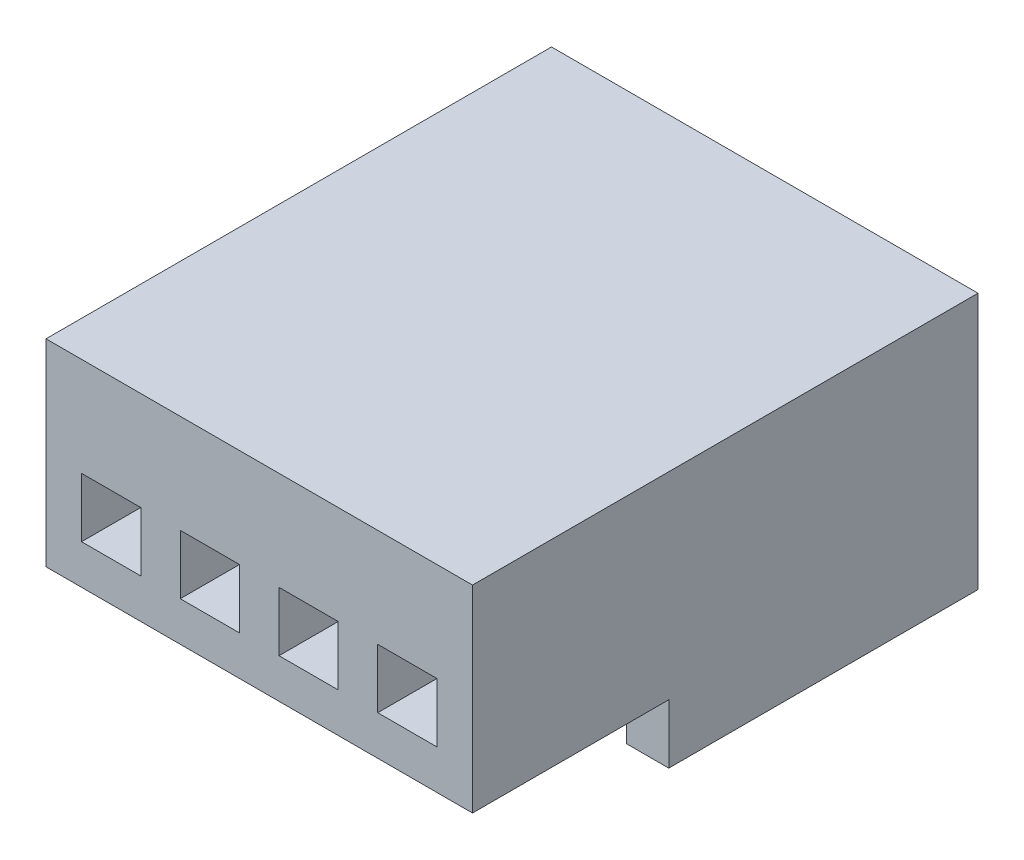
ISO-10303-21;
HEADER;
FILE_DESCRIPTION(('STEP AP214'),'2;1');
FILE_NAME('part.step','',(''),(''),'','','');
FILE_SCHEMA(('AUTOMOTIVE_DESIGN { 1 0 10303 214 1 1 1 1 }'));
ENDSEC;
DATA;
#1=APPLICATION_CONTEXT('core data for automotive mechanical design processes');
#2=APPLICATION_PROTOCOL_DEFINITION('international standard','automotive_design',2000,#1);
#3=PRODUCT_CONTEXT('',#1,'mechanical');
#4=PRODUCT('Part','Part','',(#3));
#5=PRODUCT_RELATED_PRODUCT_CATEGORY('part','',(#4));
#6=PRODUCT_DEFINITION_FORMATION('','',#4);
#7=PRODUCT_DEFINITION_CONTEXT('part definition',#1,'design');
#8=PRODUCT_DEFINITION('design','',#6,#7);
#9=PRODUCT_DEFINITION_SHAPE('','',#8);
#10=(LENGTH_UNIT() NAMED_UNIT(*) SI_UNIT(.MILLI.,.METRE.));
#11=(NAMED_UNIT(*) PLANE_ANGLE_UNIT() SI_UNIT($,.RADIAN.));
#12=(NAMED_UNIT(*) SI_UNIT($,.STERADIAN.) SOLID_ANGLE_UNIT());
#13=UNCERTAINTY_MEASURE_WITH_UNIT(LENGTH_MEASURE(1.E-05),#10,'distance_accuracy_value','');
#14=(GEOMETRIC_REPRESENTATION_CONTEXT(3) GLOBAL_UNCERTAINTY_ASSIGNED_CONTEXT((#13)) GLOBAL_UNIT_ASSIGNED_CONTEXT((#10,
#11,#12)) REPRESENTATION_CONTEXT('',''));
#15=CARTESIAN_POINT('',(0.,0.,0.));
#16=DIRECTION('',(0.,0.,1.));
#17=DIRECTION('',(1.,0.,0.));
#18=AXIS2_PLACEMENT_3D('',#15,#16,#17);
#19=CARTESIAN_POINT('',(0.,0.,0.));
#20=DIRECTION('',(0.,-1.,0.));
#21=DIRECTION('',(0.,0.,-1.));
#22=AXIS2_PLACEMENT_3D('',#19,#20,#21);
#23=PLANE('',#22);
#24=DIRECTION('',(0.,0.,-1.));
#25=VECTOR('',#24,1.);
#26=CARTESIAN_POINT('',(4.33491797227326,0.,-12.8));
#27=LINE('',#26,#25);
#28=CARTESIAN_POINT('',(4.33491797227326,0.,-4.96930572851849));
#29=VERTEX_POINT('',#28);
#30=CARTESIAN_POINT('',(4.33491797227325,0.,-12.8));
#31=VERTEX_POINT('',#30);
#32=EDGE_CURVE('E225',#29,#31,#27,.T.);
#33=ORIENTED_EDGE('',*,*,#32,.F.);
#34=DIRECTION('',(-1.,0.,0.));
#35=VECTOR('',#34,1.);
#36=CARTESIAN_POINT('',(5.4,0.,-4.96930572851849));
#37=LINE('',#36,#35);
#38=CARTESIAN_POINT('',(5.4,0.,-4.96930572851849));
#39=VERTEX_POINT('',#38);
#40=EDGE_CURVE('E412',#39,#29,#37,.T.);
#41=ORIENTED_EDGE('',*,*,#40,.F.);
#42=DIRECTION('',(0.,0.,-1.));
#43=VECTOR('',#42,1.);
#44=CARTESIAN_POINT('',(5.4,0.,0.));
#45=LINE('',#44,#43);
#46=CARTESIAN_POINT('',(5.4,0.,0.));
#47=VERTEX_POINT('',#46);
#48=EDGE_CURVE('E231',#47,#39,#45,.T.);
#49=ORIENTED_EDGE('',*,*,#48,.F.);
#50=DIRECTION('',(1.,0.,0.));
#51=VECTOR('',#50,1.);
#52=CARTESIAN_POINT('',(-5.4,0.,0.));
#53=LINE('',#52,#51);
#54=CARTESIAN_POINT('',(-5.4,0.,0.));
#55=VERTEX_POINT('',#54);
#56=EDGE_CURVE('E400',#55,#47,#53,.T.);
#57=ORIENTED_EDGE('',*,*,#56,.F.);
#58=DIRECTION('',(0.,0.,1.));
#59=VECTOR('',#58,1.);
#60=CARTESIAN_POINT('',(-5.4,0.,0.));
#61=LINE('',#60,#59);
#62=CARTESIAN_POINT('',(-5.4,0.,-4.96930572851849));
#63=VERTEX_POINT('',#62);
#64=EDGE_CURVE('E288',#63,#55,#61,.T.);
#65=ORIENTED_EDGE('',*,*,#64,.F.);
#66=DIRECTION('',(-1.,0.,0.));
#67=VECTOR('',#66,1.);
#68=CARTESIAN_POINT('',(-5.4,0.,-4.96930572851849));
#69=LINE('',#68,#67);
#70=CARTESIAN_POINT('',(-4.42058828793083,0.,-4.96930572851849));
#71=VERTEX_POINT('',#70);
#72=EDGE_CURVE('E235',#71,#63,#69,.T.);
#73=ORIENTED_EDGE('',*,*,#72,.F.);
#74=DIRECTION('',(0.,0.,1.));
#75=VECTOR('',#74,1.);
#76=CARTESIAN_POINT('',(-4.42058828793083,0.,-12.8));
#77=LINE('',#76,#75);
#78=CARTESIAN_POINT('',(-4.42058828793083,0.,-12.8));
#79=VERTEX_POINT('',#78);
#80=EDGE_CURVE('E232',#79,#71,#77,.T.);
#81=ORIENTED_EDGE('',*,*,#80,.F.);
#82=DIRECTION('',(-1.,0.,0.));
#83=VECTOR('',#82,1.);
#84=CARTESIAN_POINT('',(-5.4,0.,-12.8));
#85=LINE('',#84,#83);
#86=EDGE_CURVE('E53',#31,#79,#85,.T.);
#87=ORIENTED_EDGE('',*,*,#86,.F.);
#88=EDGE_LOOP('',(#33,#41,#49,#57,#65,#73,#81,#87));
#89=FACE_BOUND('',#88,.T.);
#90=ADVANCED_FACE('F33',(#89),#23,.T.);
#91=CARTESIAN_POINT('',(-5.4,5.,0.));
#92=DIRECTION('',(1.,0.,0.));
#93=DIRECTION('',(0.,0.,-1.));
#94=AXIS2_PLACEMENT_3D('',#91,#92,#93);
#95=PLANE('',#94);
#96=DIRECTION('',(0.,-1.,0.));
#97=VECTOR('',#96,1.);
#98=CARTESIAN_POINT('',(-5.4,5.,-12.8));
#99=LINE('',#98,#97);
#100=CARTESIAN_POINT('',(-5.4,5.,-12.8));
#101=VERTEX_POINT('',#100);
#102=CARTESIAN_POINT('',(-5.4,-1.5,-12.8));
#103=VERTEX_POINT('',#102);
#104=EDGE_CURVE('E398',#101,#103,#99,.T.);
#105=ORIENTED_EDGE('',*,*,#104,.T.);
#106=DIRECTION('',(0.,0.,-1.));
#107=VECTOR('',#106,1.);
#108=CARTESIAN_POINT('',(-5.4,-1.5,-12.8));
#109=LINE('',#108,#107);
#110=CARTESIAN_POINT('',(-5.4,-1.5,-4.96930572851849));
#111=VERTEX_POINT('',#110);
#112=EDGE_CURVE('E240',#111,#103,#109,.T.);
#113=ORIENTED_EDGE('',*,*,#112,.F.);
#114=DIRECTION('',(0.,1.,0.));
#115=VECTOR('',#114,1.);
#116=CARTESIAN_POINT('',(-5.4,-1.5,-4.96930572851849));
#117=LINE('',#116,#115);
#118=EDGE_CURVE('E248',#111,#63,#117,.T.);
#119=ORIENTED_EDGE('',*,*,#118,.T.);
#120=ORIENTED_EDGE('',*,*,#64,.T.);
#121=DIRECTION('',(0.,-1.,0.));
#122=VECTOR('',#121,1.);
#123=CARTESIAN_POINT('',(-5.4,5.,0.));
#124=LINE('',#123,#122);
#125=CARTESIAN_POINT('',(-5.4,5.,0.));
#126=VERTEX_POINT('',#125);
#127=EDGE_CURVE('E11',#126,#55,#124,.T.);
#128=ORIENTED_EDGE('',*,*,#127,.F.);
#129=DIRECTION('',(0.,0.,1.));
#130=VECTOR('',#129,1.);
#131=CARTESIAN_POINT('',(-5.4,5.,0.));
#132=LINE('',#131,#130);
#133=EDGE_CURVE('E389',#101,#126,#132,.T.);
#134=ORIENTED_EDGE('',*,*,#133,.F.);
#135=EDGE_LOOP('',(#105,#113,#119,#120,#128,#134));
#136=FACE_BOUND('',#135,.T.);
#137=ADVANCED_FACE('F35',(#136),#95,.F.);
#138=CARTESIAN_POINT('',(-5.4,5.,0.));
#139=DIRECTION('',(0.,0.,-1.));
#140=DIRECTION('',(-1.,0.,0.));
#141=AXIS2_PLACEMENT_3D('',#138,#139,#140);
#142=PLANE('',#141);
#143=DIRECTION('',(1.,0.,0.));
#144=VECTOR('',#143,1.);
#145=CARTESIAN_POINT('',(4.5,2.5,0.));
#146=LINE('',#145,#144);
#147=CARTESIAN_POINT('',(3.,2.5,0.));
#148=VERTEX_POINT('',#147);
#149=CARTESIAN_POINT('',(4.5,2.5,0.));
#150=VERTEX_POINT('',#149);
#151=EDGE_CURVE('E271',#148,#150,#146,.T.);
#152=ORIENTED_EDGE('',*,*,#151,.T.);
#153=DIRECTION('',(0.,-1.,0.));
#154=VECTOR('',#153,1.);
#155=CARTESIAN_POINT('',(4.5,2.5,0.));
#156=LINE('',#155,#154);
#157=CARTESIAN_POINT('',(4.5,1.,0.));
#158=VERTEX_POINT('',#157);
#159=EDGE_CURVE('E261',#150,#158,#156,.T.);
#160=ORIENTED_EDGE('',*,*,#159,.T.);
#161=DIRECTION('',(-1.,0.,0.));
#162=VECTOR('',#161,1.);
#163=CARTESIAN_POINT('',(4.5,1.,0.));
#164=LINE('',#163,#162);
#165=CARTESIAN_POINT('',(3.,1.,0.));
#166=VERTEX_POINT('',#165);
#167=EDGE_CURVE('E264',#158,#166,#164,.T.);
#168=ORIENTED_EDGE('',*,*,#167,.T.);
#169=DIRECTION('',(0.,1.,0.));
#170=VECTOR('',#169,1.);
#171=CARTESIAN_POINT('',(3.,2.5,0.));
#172=LINE('',#171,#170);
#173=EDGE_CURVE('E268',#166,#148,#172,.T.);
#174=ORIENTED_EDGE('',*,*,#173,.T.);
#175=EDGE_LOOP('',(#152,#160,#168,#174));
#176=FACE_BOUND('',#175,.T.);
#177=DIRECTION('',(1.,0.,0.));
#178=VECTOR('',#177,1.);
#179=CARTESIAN_POINT('',(2.,2.5,0.));
#180=LINE('',#179,#178);
#181=CARTESIAN_POINT('',(0.5,2.5,0.));
#182=VERTEX_POINT('',#181);
#183=CARTESIAN_POINT('',(2.,2.5,0.));
#184=VERTEX_POINT('',#183);
#185=EDGE_CURVE('E305',#182,#184,#180,.T.);
#186=ORIENTED_EDGE('',*,*,#185,.T.);
#187=DIRECTION('',(0.,-1.,0.));
#188=VECTOR('',#187,1.);
#189=CARTESIAN_POINT('',(2.,2.5,0.));
#190=LINE('',#189,#188);
#191=CARTESIAN_POINT('',(2.,1.,0.));
#192=VERTEX_POINT('',#191);
#193=EDGE_CURVE('E295',#184,#192,#190,.T.);
#194=ORIENTED_EDGE('',*,*,#193,.T.);
#195=DIRECTION('',(-1.,0.,0.));
#196=VECTOR('',#195,1.);
#197=CARTESIAN_POINT('',(2.,1.,0.));
#198=LINE('',#197,#196);
#199=CARTESIAN_POINT('',(0.499999999999999,1.,0.));
#200=VERTEX_POINT('',#199);
#201=EDGE_CURVE('E298',#192,#200,#198,.T.);
#202=ORIENTED_EDGE('',*,*,#201,.T.);
#203=DIRECTION('',(0.,1.,0.));
#204=VECTOR('',#203,1.);
#205=CARTESIAN_POINT('',(0.5,2.5,0.));
#206=LINE('',#205,#204);
#207=EDGE_CURVE('E302',#200,#182,#206,.T.);
#208=ORIENTED_EDGE('',*,*,#207,.T.);
#209=EDGE_LOOP('',(#186,#194,#202,#208));
#210=FACE_BOUND('',#209,.T.);
#211=DIRECTION('',(1.,0.,0.));
#212=VECTOR('',#211,1.);
#213=CARTESIAN_POINT('',(-0.5,2.5,0.));
#214=LINE('',#213,#212);
#215=CARTESIAN_POINT('',(-2.,2.5,0.));
#216=VERTEX_POINT('',#215);
#217=CARTESIAN_POINT('',(-0.5,2.5,0.));
#218=VERTEX_POINT('',#217);
#219=EDGE_CURVE('E337',#216,#218,#214,.T.);
#220=ORIENTED_EDGE('',*,*,#219,.T.);
#221=DIRECTION('',(0.,-1.,0.));
#222=VECTOR('',#221,1.);
#223=CARTESIAN_POINT('',(-0.5,2.5,0.));
#224=LINE('',#223,#222);
#225=CARTESIAN_POINT('',(-0.500000000000001,1.,0.));
#226=VERTEX_POINT('',#225);
#227=EDGE_CURVE('E327',#218,#226,#224,.T.);
#228=ORIENTED_EDGE('',*,*,#227,.T.);
#229=DIRECTION('',(-1.,0.,0.));
#230=VECTOR('',#229,1.);
#231=CARTESIAN_POINT('',(-0.500000000000001,1.,0.));
#232=LINE('',#231,#230);
#233=CARTESIAN_POINT('',(-2.,1.,0.));
#234=VERTEX_POINT('',#233);
#235=EDGE_CURVE('E330',#226,#234,#232,.T.);
#236=ORIENTED_EDGE('',*,*,#235,.T.);
#237=DIRECTION('',(0.,1.,0.));
#238=VECTOR('',#237,1.);
#239=CARTESIAN_POINT('',(-2.,2.5,0.));
#240=LINE('',#239,#238);
#241=EDGE_CURVE('E334',#234,#216,#240,.T.);
#242=ORIENTED_EDGE('',*,*,#241,.T.);
#243=EDGE_LOOP('',(#220,#228,#236,#242));
#244=FACE_BOUND('',#243,.T.);
#245=DIRECTION('',(1.,0.,0.));
#246=VECTOR('',#245,1.);
#247=CARTESIAN_POINT('',(-3.,2.5,0.));
#248=LINE('',#247,#246);
#249=CARTESIAN_POINT('',(-4.5,2.5,0.));
#250=VERTEX_POINT('',#249);
#251=CARTESIAN_POINT('',(-3.,2.5,0.));
#252=VERTEX_POINT('',#251);
#253=EDGE_CURVE('E369',#250,#252,#248,.T.);
#254=ORIENTED_EDGE('',*,*,#253,.T.);
#255=DIRECTION('',(0.,-1.,0.));
#256=VECTOR('',#255,1.);
#257=CARTESIAN_POINT('',(-3.,2.5,0.));
#258=LINE('',#257,#256);
#259=CARTESIAN_POINT('',(-3.,1.,0.));
#260=VERTEX_POINT('',#259);
#261=EDGE_CURVE('E359',#252,#260,#258,.T.);
#262=ORIENTED_EDGE('',*,*,#261,.T.);
#263=DIRECTION('',(-1.,0.,0.));
#264=VECTOR('',#263,1.);
#265=CARTESIAN_POINT('',(-3.,1.,0.));
#266=LINE('',#265,#264);
#267=CARTESIAN_POINT('',(-4.5,1.,0.));
#268=VERTEX_POINT('',#267);
#269=EDGE_CURVE('E362',#260,#268,#266,.T.);
#270=ORIENTED_EDGE('',*,*,#269,.T.);
#271=DIRECTION('',(0.,1.,0.));
#272=VECTOR('',#271,1.);
#273=CARTESIAN_POINT('',(-4.5,2.5,0.));
#274=LINE('',#273,#272);
#275=EDGE_CURVE('E366',#268,#250,#274,.T.);
#276=ORIENTED_EDGE('',*,*,#275,.T.);
#277=EDGE_LOOP('',(#254,#262,#270,#276));
#278=FACE_BOUND('',#277,.T.);
#279=ORIENTED_EDGE('',*,*,#56,.T.);
#280=DIRECTION('',(0.,-1.,0.));
#281=VECTOR('',#280,1.);
#282=CARTESIAN_POINT('',(5.4,5.,0.));
#283=LINE('',#282,#281);
#284=CARTESIAN_POINT('',(5.4,5.,0.));
#285=VERTEX_POINT('',#284);
#286=EDGE_CURVE('E41',#285,#47,#283,.T.);
#287=ORIENTED_EDGE('',*,*,#286,.F.);
#288=DIRECTION('',(1.,0.,0.));
#289=VECTOR('',#288,1.);
#290=CARTESIAN_POINT('',(-5.4,5.,0.));
#291=LINE('',#290,#289);
#292=EDGE_CURVE('E392',#126,#285,#291,.T.);
#293=ORIENTED_EDGE('',*,*,#292,.F.);
#294=ORIENTED_EDGE('',*,*,#127,.T.);
#295=EDGE_LOOP('',(#279,#287,#293,#294));
#296=FACE_BOUND('',#295,.T.);
#297=ADVANCED_FACE('F427',(#176,#210,#244,#278,#296),#142,.F.);
#298=CARTESIAN_POINT('',(5.4,5.,0.));
#299=DIRECTION('',(-1.,0.,0.));
#300=DIRECTION('',(0.,0.,1.));
#301=AXIS2_PLACEMENT_3D('',#298,#299,#300);
#302=PLANE('',#301);
#303=ORIENTED_EDGE('',*,*,#48,.T.);
#304=DIRECTION('',(0.,1.,0.));
#305=VECTOR('',#304,1.);
#306=CARTESIAN_POINT('',(5.4,-1.5,-4.96930572851849));
#307=LINE('',#306,#305);
#308=CARTESIAN_POINT('',(5.4,-1.5,-4.96930572851849));
#309=VERTEX_POINT('',#308);
#310=EDGE_CURVE('E210',#309,#39,#307,.T.);
#311=ORIENTED_EDGE('',*,*,#310,.F.);
#312=DIRECTION('',(0.,0.,1.));
#313=VECTOR('',#312,1.);
#314=CARTESIAN_POINT('',(5.4,-1.5,-12.8));
#315=LINE('',#314,#313);
#316=CARTESIAN_POINT('',(5.4,-1.5,-12.8));
#317=VERTEX_POINT('',#316);
#318=EDGE_CURVE('E217',#317,#309,#315,.T.);
#319=ORIENTED_EDGE('',*,*,#318,.F.);
#320=DIRECTION('',(0.,-1.,0.));
#321=VECTOR('',#320,1.);
#322=CARTESIAN_POINT('',(5.4,5.,-12.8));
#323=LINE('',#322,#321);
#324=CARTESIAN_POINT('',(5.4,5.,-12.8));
#325=VERTEX_POINT('',#324);
#326=EDGE_CURVE('E405',#325,#317,#323,.T.);
#327=ORIENTED_EDGE('',*,*,#326,.F.);
#328=DIRECTION('',(0.,0.,-1.));
#329=VECTOR('',#328,1.);
#330=CARTESIAN_POINT('',(5.4,5.,0.));
#331=LINE('',#330,#329);
#332=EDGE_CURVE('E394',#285,#325,#331,.T.);
#333=ORIENTED_EDGE('',*,*,#332,.F.);
#334=ORIENTED_EDGE('',*,*,#286,.T.);
#335=EDGE_LOOP('',(#303,#311,#319,#327,#333,#334));
#336=FACE_BOUND('',#335,.T.);
#337=ADVANCED_FACE('F228',(#336),#302,.F.);
#338=CARTESIAN_POINT('',(-5.4,5.,-12.8));
#339=DIRECTION('',(0.,0.,1.));
#340=DIRECTION('',(1.,0.,0.));
#341=AXIS2_PLACEMENT_3D('',#338,#339,#340);
#342=PLANE('',#341);
#343=DIRECTION('',(-1.,0.,0.));
#344=VECTOR('',#343,1.);
#345=CARTESIAN_POINT('',(4.5,1.,-12.8));
#346=LINE('',#345,#344);
#347=CARTESIAN_POINT('',(4.5,1.,-12.8));
#348=VERTEX_POINT('',#347);
#349=CARTESIAN_POINT('',(3.,1.,-12.8));
#350=VERTEX_POINT('',#349);
#351=EDGE_CURVE('E277',#348,#350,#346,.T.);
#352=ORIENTED_EDGE('',*,*,#351,.F.);
#353=DIRECTION('',(0.,-1.,0.));
#354=VECTOR('',#353,1.);
#355=CARTESIAN_POINT('',(4.5,2.5,-12.8));
#356=LINE('',#355,#354);
#357=CARTESIAN_POINT('',(4.5,2.5,-12.8));
#358=VERTEX_POINT('',#357);
#359=EDGE_CURVE('E275',#358,#348,#356,.T.);
#360=ORIENTED_EDGE('',*,*,#359,.F.);
#361=DIRECTION('',(1.,0.,0.));
#362=VECTOR('',#361,1.);
#363=CARTESIAN_POINT('',(4.5,2.5,-12.8));
#364=LINE('',#363,#362);
#365=CARTESIAN_POINT('',(3.,2.5,-12.8));
#366=VERTEX_POINT('',#365);
#367=EDGE_CURVE('E265',#366,#358,#364,.T.);
#368=ORIENTED_EDGE('',*,*,#367,.F.);
#369=DIRECTION('',(0.,1.,0.));
#370=VECTOR('',#369,1.);
#371=CARTESIAN_POINT('',(3.,2.5,-12.8));
#372=LINE('',#371,#370);
#373=EDGE_CURVE('E281',#350,#366,#372,.T.);
#374=ORIENTED_EDGE('',*,*,#373,.F.);
#375=EDGE_LOOP('',(#352,#360,#368,#374));
#376=FACE_BOUND('',#375,.T.);
#377=DIRECTION('',(-1.,0.,0.));
#378=VECTOR('',#377,1.);
#379=CARTESIAN_POINT('',(2.,1.,-12.8));
#380=LINE('',#379,#378);
#381=CARTESIAN_POINT('',(2.,1.,-12.8));
#382=VERTEX_POINT('',#381);
#383=CARTESIAN_POINT('',(0.499999999999999,1.,-12.8));
#384=VERTEX_POINT('',#383);
#385=EDGE_CURVE('E311',#382,#384,#380,.T.);
#386=ORIENTED_EDGE('',*,*,#385,.F.);
#387=DIRECTION('',(0.,-1.,0.));
#388=VECTOR('',#387,1.);
#389=CARTESIAN_POINT('',(2.,2.5,-12.8));
#390=LINE('',#389,#388);
#391=CARTESIAN_POINT('',(2.,2.5,-12.8));
#392=VERTEX_POINT('',#391);
#393=EDGE_CURVE('E309',#392,#382,#390,.T.);
#394=ORIENTED_EDGE('',*,*,#393,.F.);
#395=DIRECTION('',(1.,0.,0.));
#396=VECTOR('',#395,1.);
#397=CARTESIAN_POINT('',(2.,2.5,-12.8));
#398=LINE('',#397,#396);
#399=CARTESIAN_POINT('',(0.5,2.5,-12.8));
#400=VERTEX_POINT('',#399);
#401=EDGE_CURVE('E299',#400,#392,#398,.T.);
#402=ORIENTED_EDGE('',*,*,#401,.F.);
#403=DIRECTION('',(0.,1.,0.));
#404=VECTOR('',#403,1.);
#405=CARTESIAN_POINT('',(0.5,2.5,-12.8));
#406=LINE('',#405,#404);
#407=EDGE_CURVE('E315',#384,#400,#406,.T.);
#408=ORIENTED_EDGE('',*,*,#407,.F.);
#409=EDGE_LOOP('',(#386,#394,#402,#408));
#410=FACE_BOUND('',#409,.T.);
#411=DIRECTION('',(-1.,0.,0.));
#412=VECTOR('',#411,1.);
#413=CARTESIAN_POINT('',(-0.500000000000001,1.,-12.8));
#414=LINE('',#413,#412);
#415=CARTESIAN_POINT('',(-0.5,1.,-12.8));
#416=VERTEX_POINT('',#415);
#417=CARTESIAN_POINT('',(-2.,1.,-12.8));
#418=VERTEX_POINT('',#417);
#419=EDGE_CURVE('E343',#416,#418,#414,.T.);
#420=ORIENTED_EDGE('',*,*,#419,.F.);
#421=DIRECTION('',(0.,-1.,0.));
#422=VECTOR('',#421,1.);
#423=CARTESIAN_POINT('',(-0.5,2.5,-12.8));
#424=LINE('',#423,#422);
#425=CARTESIAN_POINT('',(-0.5,2.5,-12.8));
#426=VERTEX_POINT('',#425);
#427=EDGE_CURVE('E341',#426,#416,#424,.T.);
#428=ORIENTED_EDGE('',*,*,#427,.F.);
#429=DIRECTION('',(1.,0.,0.));
#430=VECTOR('',#429,1.);
#431=CARTESIAN_POINT('',(-0.5,2.5,-12.8));
#432=LINE('',#431,#430);
#433=CARTESIAN_POINT('',(-2.,2.5,-12.8));
#434=VERTEX_POINT('',#433);
#435=EDGE_CURVE('E331',#434,#426,#432,.T.);
#436=ORIENTED_EDGE('',*,*,#435,.F.);
#437=DIRECTION('',(0.,1.,0.));
#438=VECTOR('',#437,1.);
#439=CARTESIAN_POINT('',(-2.,2.5,-12.8));
#440=LINE('',#439,#438);
#441=EDGE_CURVE('E347',#418,#434,#440,.T.);
#442=ORIENTED_EDGE('',*,*,#441,.F.);
#443=EDGE_LOOP('',(#420,#428,#436,#442));
#444=FACE_BOUND('',#443,.T.);
#445=DIRECTION('',(-1.,0.,0.));
#446=VECTOR('',#445,1.);
#447=CARTESIAN_POINT('',(-3.,1.,-12.8));
#448=LINE('',#447,#446);
#449=CARTESIAN_POINT('',(-3.,1.,-12.8));
#450=VERTEX_POINT('',#449);
#451=CARTESIAN_POINT('',(-4.5,1.,-12.8));
#452=VERTEX_POINT('',#451);
#453=EDGE_CURVE('E374',#450,#452,#448,.T.);
#454=ORIENTED_EDGE('',*,*,#453,.F.);
#455=DIRECTION('',(0.,-1.,0.));
#456=VECTOR('',#455,1.);
#457=CARTESIAN_POINT('',(-3.,2.5,-12.8));
#458=LINE('',#457,#456);
#459=CARTESIAN_POINT('',(-3.,2.5,-12.8));
#460=VERTEX_POINT('',#459);
#461=EDGE_CURVE('E260',#460,#450,#458,.T.);
#462=ORIENTED_EDGE('',*,*,#461,.F.);
#463=DIRECTION('',(1.,0.,0.));
#464=VECTOR('',#463,1.);
#465=CARTESIAN_POINT('',(-3.,2.5,-12.8));
#466=LINE('',#465,#464);
#467=CARTESIAN_POINT('',(-4.5,2.5,-12.8));
#468=VERTEX_POINT('',#467);
#469=EDGE_CURVE('E363',#468,#460,#466,.T.);
#470=ORIENTED_EDGE('',*,*,#469,.F.);
#471=DIRECTION('',(0.,1.,0.));
#472=VECTOR('',#471,1.);
#473=CARTESIAN_POINT('',(-4.5,2.5,-12.8));
#474=LINE('',#473,#472);
#475=EDGE_CURVE('E377',#452,#468,#474,.T.);
#476=ORIENTED_EDGE('',*,*,#475,.F.);
#477=EDGE_LOOP('',(#454,#462,#470,#476));
#478=FACE_BOUND('',#477,.T.);
#479=ORIENTED_EDGE('',*,*,#326,.T.);
#480=DIRECTION('',(1.,0.,0.));
#481=VECTOR('',#480,1.);
#482=CARTESIAN_POINT('',(5.4,-1.5,-12.8));
#483=LINE('',#482,#481);
#484=CARTESIAN_POINT('',(4.33491797227326,-1.5,-12.8));
#485=VERTEX_POINT('',#484);
#486=EDGE_CURVE('E222',#485,#317,#483,.T.);
#487=ORIENTED_EDGE('',*,*,#486,.F.);
#488=DIRECTION('',(0.,1.,0.));
#489=VECTOR('',#488,1.);
#490=CARTESIAN_POINT('',(4.33491797227326,-1.5,-12.8));
#491=LINE('',#490,#489);
#492=EDGE_CURVE('E48',#485,#31,#491,.T.);
#493=ORIENTED_EDGE('',*,*,#492,.T.);
#494=ORIENTED_EDGE('',*,*,#86,.T.);
#495=DIRECTION('',(0.,1.,0.));
#496=VECTOR('',#495,1.);
#497=CARTESIAN_POINT('',(-4.42058828793083,-1.5,-12.8));
#498=LINE('',#497,#496);
#499=CARTESIAN_POINT('',(-4.42058828793083,-1.5,-12.8));
#500=VERTEX_POINT('',#499);
#501=EDGE_CURVE('E257',#500,#79,#498,.T.);
#502=ORIENTED_EDGE('',*,*,#501,.F.);
#503=DIRECTION('',(1.,0.,0.));
#504=VECTOR('',#503,1.);
#505=CARTESIAN_POINT('',(-5.4,-1.5,-12.8));
#506=LINE('',#505,#504);
#507=EDGE_CURVE('E243',#103,#500,#506,.T.);
#508=ORIENTED_EDGE('',*,*,#507,.F.);
#509=ORIENTED_EDGE('',*,*,#104,.F.);
#510=DIRECTION('',(-1.,0.,0.));
#511=VECTOR('',#510,1.);
#512=CARTESIAN_POINT('',(-5.4,5.,-12.8));
#513=LINE('',#512,#511);
#514=EDGE_CURVE('E396',#325,#101,#513,.T.);
#515=ORIENTED_EDGE('',*,*,#514,.F.);
#516=EDGE_LOOP('',(#479,#487,#493,#494,#502,#508,#509,#515));
#517=FACE_BOUND('',#516,.T.);
#518=ADVANCED_FACE('F419',(#376,#410,#444,#478,#517),#342,.F.);
#519=CARTESIAN_POINT('',(0.,5.,0.));
#520=DIRECTION('',(0.,-1.,0.));
#521=DIRECTION('',(0.,0.,-1.));
#522=AXIS2_PLACEMENT_3D('',#519,#520,#521);
#523=PLANE('',#522);
#524=ORIENTED_EDGE('',*,*,#133,.T.);
#525=ORIENTED_EDGE('',*,*,#292,.T.);
#526=ORIENTED_EDGE('',*,*,#332,.T.);
#527=ORIENTED_EDGE('',*,*,#514,.T.);
#528=EDGE_LOOP('',(#524,#525,#526,#527));
#529=FACE_BOUND('',#528,.T.);
#530=ADVANCED_FACE('F425',(#529),#523,.F.);
#531=CARTESIAN_POINT('',(-3.,2.5,0.));
#532=DIRECTION('',(1.,0.,0.));
#533=DIRECTION('',(0.,0.,-1.));
#534=AXIS2_PLACEMENT_3D('',#531,#532,#533);
#535=PLANE('',#534);
#536=ORIENTED_EDGE('',*,*,#461,.T.);
#537=DIRECTION('',(0.,0.,-1.));
#538=VECTOR('',#537,1.);
#539=CARTESIAN_POINT('',(-3.,1.,0.));
#540=LINE('',#539,#538);
#541=EDGE_CURVE('E372',#260,#450,#540,.T.);
#542=ORIENTED_EDGE('',*,*,#541,.F.);
#543=ORIENTED_EDGE('',*,*,#261,.F.);
#544=DIRECTION('',(0.,0.,-1.));
#545=VECTOR('',#544,1.);
#546=CARTESIAN_POINT('',(-3.,2.5,0.));
#547=LINE('',#546,#545);
#548=EDGE_CURVE('E344',#252,#460,#547,.T.);
#549=ORIENTED_EDGE('',*,*,#548,.T.);
#550=EDGE_LOOP('',(#536,#542,#543,#549));
#551=FACE_BOUND('',#550,.T.);
#552=ADVANCED_FACE('F477',(#551),#535,.F.);
#553=CARTESIAN_POINT('',(-3.,2.5,0.));
#554=DIRECTION('',(0.,1.,0.));
#555=DIRECTION('',(0.,0.,1.));
#556=AXIS2_PLACEMENT_3D('',#553,#554,#555);
#557=PLANE('',#556);
#558=ORIENTED_EDGE('',*,*,#469,.T.);
#559=ORIENTED_EDGE('',*,*,#548,.F.);
#560=ORIENTED_EDGE('',*,*,#253,.F.);
#561=DIRECTION('',(0.,0.,-1.));
#562=VECTOR('',#561,1.);
#563=CARTESIAN_POINT('',(-4.5,2.5,0.));
#564=LINE('',#563,#562);
#565=EDGE_CURVE('E383',#250,#468,#564,.T.);
#566=ORIENTED_EDGE('',*,*,#565,.T.);
#567=EDGE_LOOP('',(#558,#559,#560,#566));
#568=FACE_BOUND('',#567,.T.);
#569=ADVANCED_FACE('F473',(#568),#557,.F.);
#570=CARTESIAN_POINT('',(-4.5,2.5,0.));
#571=DIRECTION('',(-1.,0.,0.));
#572=DIRECTION('',(0.,0.,1.));
#573=AXIS2_PLACEMENT_3D('',#570,#571,#572);
#574=PLANE('',#573);
#575=ORIENTED_EDGE('',*,*,#475,.T.);
#576=ORIENTED_EDGE('',*,*,#565,.F.);
#577=ORIENTED_EDGE('',*,*,#275,.F.);
#578=DIRECTION('',(0.,0.,-1.));
#579=VECTOR('',#578,1.);
#580=CARTESIAN_POINT('',(-4.5,1.,0.));
#581=LINE('',#580,#579);
#582=EDGE_CURVE('E385',#268,#452,#581,.T.);
#583=ORIENTED_EDGE('',*,*,#582,.T.);
#584=EDGE_LOOP('',(#575,#576,#577,#583));
#585=FACE_BOUND('',#584,.T.);
#586=ADVANCED_FACE('F485',(#585),#574,.F.);
#587=CARTESIAN_POINT('',(-3.,1.,0.));
#588=DIRECTION('',(0.,-1.,0.));
#589=DIRECTION('',(0.,0.,-1.));
#590=AXIS2_PLACEMENT_3D('',#587,#588,#589);
#591=PLANE('',#590);
#592=ORIENTED_EDGE('',*,*,#453,.T.);
#593=ORIENTED_EDGE('',*,*,#582,.F.);
#594=ORIENTED_EDGE('',*,*,#269,.F.);
#595=ORIENTED_EDGE('',*,*,#541,.T.);
#596=EDGE_LOOP('',(#592,#593,#594,#595));
#597=FACE_BOUND('',#596,.T.);
#598=ADVANCED_FACE('F482',(#597),#591,.F.);
#599=CARTESIAN_POINT('',(-0.5,2.5,0.));
#600=DIRECTION('',(1.,0.,0.));
#601=DIRECTION('',(0.,1.,0.));
#602=AXIS2_PLACEMENT_3D('',#599,#600,#601);
#603=PLANE('',#602);
#604=ORIENTED_EDGE('',*,*,#427,.T.);
#605=DIRECTION('',(0.,0.,-1.));
#606=VECTOR('',#605,1.);
#607=CARTESIAN_POINT('',(-0.500000000000001,1.,0.));
#608=LINE('',#607,#606);
#609=EDGE_CURVE('E340',#226,#416,#608,.T.);
#610=ORIENTED_EDGE('',*,*,#609,.F.);
#611=ORIENTED_EDGE('',*,*,#227,.F.);
#612=DIRECTION('',(0.,0.,-1.));
#613=VECTOR('',#612,1.);
#614=CARTESIAN_POINT('',(-0.5,2.5,0.));
#615=LINE('',#614,#613);
#616=EDGE_CURVE('E312',#218,#426,#615,.T.);
#617=ORIENTED_EDGE('',*,*,#616,.T.);
#618=EDGE_LOOP('',(#604,#610,#611,#617));
#619=FACE_BOUND('',#618,.T.);
#620=ADVANCED_FACE('F493',(#619),#603,.F.);
#621=CARTESIAN_POINT('',(-0.5,2.5,0.));
#622=DIRECTION('',(0.,1.,0.));
#623=DIRECTION('',(-1.,0.,0.));
#624=AXIS2_PLACEMENT_3D('',#621,#622,#623);
#625=PLANE('',#624);
#626=ORIENTED_EDGE('',*,*,#435,.T.);
#627=ORIENTED_EDGE('',*,*,#616,.F.);
#628=ORIENTED_EDGE('',*,*,#219,.F.);
#629=DIRECTION('',(0.,0.,-1.));
#630=VECTOR('',#629,1.);
#631=CARTESIAN_POINT('',(-2.,2.5,0.));
#632=LINE('',#631,#630);
#633=EDGE_CURVE('E353',#216,#434,#632,.T.);
#634=ORIENTED_EDGE('',*,*,#633,.T.);
#635=EDGE_LOOP('',(#626,#627,#628,#634));
#636=FACE_BOUND('',#635,.T.);
#637=ADVANCED_FACE('F626',(#636),#625,.F.);
#638=CARTESIAN_POINT('',(-2.,2.5,0.));
#639=DIRECTION('',(-1.,0.,0.));
#640=DIRECTION('',(0.,0.,1.));
#641=AXIS2_PLACEMENT_3D('',#638,#639,#640);
#642=PLANE('',#641);
#643=ORIENTED_EDGE('',*,*,#441,.T.);
#644=ORIENTED_EDGE('',*,*,#633,.F.);
#645=ORIENTED_EDGE('',*,*,#241,.F.);
#646=DIRECTION('',(0.,0.,-1.));
#647=VECTOR('',#646,1.);
#648=CARTESIAN_POINT('',(-2.,1.,0.));
#649=LINE('',#648,#647);
#650=EDGE_CURVE('E355',#234,#418,#649,.T.);
#651=ORIENTED_EDGE('',*,*,#650,.T.);
#652=EDGE_LOOP('',(#643,#644,#645,#651));
#653=FACE_BOUND('',#652,.T.);
#654=ADVANCED_FACE('F616',(#653),#642,.F.);
#655=CARTESIAN_POINT('',(-0.500000000000001,1.,0.));
#656=DIRECTION('',(0.,-1.,0.));
#657=DIRECTION('',(0.,0.,-1.));
#658=AXIS2_PLACEMENT_3D('',#655,#656,#657);
#659=PLANE('',#658);
#660=ORIENTED_EDGE('',*,*,#419,.T.);
#661=ORIENTED_EDGE('',*,*,#650,.F.);
#662=ORIENTED_EDGE('',*,*,#235,.F.);
#663=ORIENTED_EDGE('',*,*,#609,.T.);
#664=EDGE_LOOP('',(#660,#661,#662,#663));
#665=FACE_BOUND('',#664,.T.);
#666=ADVANCED_FACE('F606',(#665),#659,.F.);
#667=CARTESIAN_POINT('',(2.,2.5,0.));
#668=DIRECTION('',(1.,0.,0.));
#669=DIRECTION('',(0.,0.,-1.));
#670=AXIS2_PLACEMENT_3D('',#667,#668,#669);
#671=PLANE('',#670);
#672=ORIENTED_EDGE('',*,*,#393,.T.);
#673=DIRECTION('',(0.,0.,-1.));
#674=VECTOR('',#673,1.);
#675=CARTESIAN_POINT('',(2.,1.,0.));
#676=LINE('',#675,#674);
#677=EDGE_CURVE('E308',#192,#382,#676,.T.);
#678=ORIENTED_EDGE('',*,*,#677,.F.);
#679=ORIENTED_EDGE('',*,*,#193,.F.);
#680=DIRECTION('',(0.,0.,-1.));
#681=VECTOR('',#680,1.);
#682=CARTESIAN_POINT('',(2.,2.5,0.));
#683=LINE('',#682,#681);
#684=EDGE_CURVE('E278',#184,#392,#683,.T.);
#685=ORIENTED_EDGE('',*,*,#684,.T.);
#686=EDGE_LOOP('',(#672,#678,#679,#685));
#687=FACE_BOUND('',#686,.T.);
#688=ADVANCED_FACE('F596',(#687),#671,.F.);
#689=CARTESIAN_POINT('',(2.,2.5,0.));
#690=DIRECTION('',(0.,1.,0.));
#691=DIRECTION('',(0.,0.,1.));
#692=AXIS2_PLACEMENT_3D('',#689,#690,#691);
#693=PLANE('',#692);
#694=ORIENTED_EDGE('',*,*,#401,.T.);
#695=ORIENTED_EDGE('',*,*,#684,.F.);
#696=ORIENTED_EDGE('',*,*,#185,.F.);
#697=DIRECTION('',(0.,0.,-1.));
#698=VECTOR('',#697,1.);
#699=CARTESIAN_POINT('',(0.5,2.5,0.));
#700=LINE('',#699,#698);
#701=EDGE_CURVE('E321',#182,#400,#700,.T.);
#702=ORIENTED_EDGE('',*,*,#701,.T.);
#703=EDGE_LOOP('',(#694,#695,#696,#702));
#704=FACE_BOUND('',#703,.T.);
#705=ADVANCED_FACE('F586',(#704),#693,.F.);
#706=CARTESIAN_POINT('',(0.5,2.5,0.));
#707=DIRECTION('',(-1.,0.,0.));
#708=DIRECTION('',(0.,-1.,0.));
#709=AXIS2_PLACEMENT_3D('',#706,#707,#708);
#710=PLANE('',#709);
#711=ORIENTED_EDGE('',*,*,#407,.T.);
#712=ORIENTED_EDGE('',*,*,#701,.F.);
#713=ORIENTED_EDGE('',*,*,#207,.F.);
#714=DIRECTION('',(0.,0.,-1.));
#715=VECTOR('',#714,1.);
#716=CARTESIAN_POINT('',(0.499999999999999,1.,0.));
#717=LINE('',#716,#715);
#718=EDGE_CURVE('E323',#200,#384,#717,.T.);
#719=ORIENTED_EDGE('',*,*,#718,.T.);
#720=EDGE_LOOP('',(#711,#712,#713,#719));
#721=FACE_BOUND('',#720,.T.);
#722=ADVANCED_FACE('F576',(#721),#710,.F.);
#723=CARTESIAN_POINT('',(2.,1.,0.));
#724=DIRECTION('',(0.,-1.,0.));
#725=DIRECTION('',(0.,0.,-1.));
#726=AXIS2_PLACEMENT_3D('',#723,#724,#725);
#727=PLANE('',#726);
#728=ORIENTED_EDGE('',*,*,#385,.T.);
#729=ORIENTED_EDGE('',*,*,#718,.F.);
#730=ORIENTED_EDGE('',*,*,#201,.F.);
#731=ORIENTED_EDGE('',*,*,#677,.T.);
#732=EDGE_LOOP('',(#728,#729,#730,#731));
#733=FACE_BOUND('',#732,.T.);
#734=ADVANCED_FACE('F566',(#733),#727,.F.);
#735=CARTESIAN_POINT('',(4.5,2.5,0.));
#736=DIRECTION('',(1.,0.,0.));
#737=DIRECTION('',(0.,0.,-1.));
#738=AXIS2_PLACEMENT_3D('',#735,#736,#737);
#739=PLANE('',#738);
#740=ORIENTED_EDGE('',*,*,#359,.T.);
#741=DIRECTION('',(0.,0.,-1.));
#742=VECTOR('',#741,1.);
#743=CARTESIAN_POINT('',(4.5,1.,0.));
#744=LINE('',#743,#742);
#745=EDGE_CURVE('E274',#158,#348,#744,.T.);
#746=ORIENTED_EDGE('',*,*,#745,.F.);
#747=ORIENTED_EDGE('',*,*,#159,.F.);
#748=DIRECTION('',(0.,0.,-1.));
#749=VECTOR('',#748,1.);
#750=CARTESIAN_POINT('',(4.5,2.5,0.));
#751=LINE('',#750,#749);
#752=EDGE_CURVE('E286',#150,#358,#751,.T.);
#753=ORIENTED_EDGE('',*,*,#752,.T.);
#754=EDGE_LOOP('',(#740,#746,#747,#753));
#755=FACE_BOUND('',#754,.T.);
#756=ADVANCED_FACE('F556',(#755),#739,.F.);
#757=CARTESIAN_POINT('',(4.5,2.5,0.));
#758=DIRECTION('',(0.,1.,0.));
#759=DIRECTION('',(0.,0.,1.));
#760=AXIS2_PLACEMENT_3D('',#757,#758,#759);
#761=PLANE('',#760);
#762=ORIENTED_EDGE('',*,*,#367,.T.);
#763=ORIENTED_EDGE('',*,*,#752,.F.);
#764=ORIENTED_EDGE('',*,*,#151,.F.);
#765=DIRECTION('',(0.,0.,-1.));
#766=VECTOR('',#765,1.);
#767=CARTESIAN_POINT('',(3.,2.5,0.));
#768=LINE('',#767,#766);
#769=EDGE_CURVE('E289',#148,#366,#768,.T.);
#770=ORIENTED_EDGE('',*,*,#769,.T.);
#771=EDGE_LOOP('',(#762,#763,#764,#770));
#772=FACE_BOUND('',#771,.T.);
#773=ADVANCED_FACE('F546',(#772),#761,.F.);
#774=CARTESIAN_POINT('',(3.,2.5,0.));
#775=DIRECTION('',(-1.,0.,0.));
#776=DIRECTION('',(0.,-1.,0.));
#777=AXIS2_PLACEMENT_3D('',#774,#775,#776);
#778=PLANE('',#777);
#779=ORIENTED_EDGE('',*,*,#373,.T.);
#780=ORIENTED_EDGE('',*,*,#769,.F.);
#781=ORIENTED_EDGE('',*,*,#173,.F.);
#782=DIRECTION('',(0.,0.,-1.));
#783=VECTOR('',#782,1.);
#784=CARTESIAN_POINT('',(3.,1.,0.));
#785=LINE('',#784,#783);
#786=EDGE_CURVE('E291',#166,#350,#785,.T.);
#787=ORIENTED_EDGE('',*,*,#786,.T.);
#788=EDGE_LOOP('',(#779,#780,#781,#787));
#789=FACE_BOUND('',#788,.T.);
#790=ADVANCED_FACE('F535',(#789),#778,.F.);
#791=CARTESIAN_POINT('',(4.5,1.,0.));
#792=DIRECTION('',(0.,-1.,0.));
#793=DIRECTION('',(0.,0.,-1.));
#794=AXIS2_PLACEMENT_3D('',#791,#792,#793);
#795=PLANE('',#794);
#796=ORIENTED_EDGE('',*,*,#351,.T.);
#797=ORIENTED_EDGE('',*,*,#786,.F.);
#798=ORIENTED_EDGE('',*,*,#167,.F.);
#799=ORIENTED_EDGE('',*,*,#745,.T.);
#800=EDGE_LOOP('',(#796,#797,#798,#799));
#801=FACE_BOUND('',#800,.T.);
#802=ADVANCED_FACE('F531',(#801),#795,.F.);
#803=CARTESIAN_POINT('',(-4.42058828793083,-1.5,-12.8));
#804=DIRECTION('',(-1.,0.,0.));
#805=DIRECTION('',(0.,0.,1.));
#806=AXIS2_PLACEMENT_3D('',#803,#804,#805);
#807=PLANE('',#806);
#808=ORIENTED_EDGE('',*,*,#80,.T.);
#809=DIRECTION('',(0.,1.,0.));
#810=VECTOR('',#809,1.);
#811=CARTESIAN_POINT('',(-4.42058828793083,-1.5,-4.96930572851849));
#812=LINE('',#811,#810);
#813=CARTESIAN_POINT('',(-4.42058828793083,-1.5,-4.96930572851849));
#814=VERTEX_POINT('',#813);
#815=EDGE_CURVE('E254',#814,#71,#812,.T.);
#816=ORIENTED_EDGE('',*,*,#815,.F.);
#817=DIRECTION('',(0.,0.,1.));
#818=VECTOR('',#817,1.);
#819=CARTESIAN_POINT('',(-4.42058828793083,-1.5,-12.8));
#820=LINE('',#819,#818);
#821=EDGE_CURVE('E245',#500,#814,#820,.T.);
#822=ORIENTED_EDGE('',*,*,#821,.F.);
#823=ORIENTED_EDGE('',*,*,#501,.T.);
#824=EDGE_LOOP('',(#808,#816,#822,#823));
#825=FACE_BOUND('',#824,.T.);
#826=ADVANCED_FACE('F437',(#825),#807,.F.);
#827=CARTESIAN_POINT('',(-5.4,-1.5,-4.96930572851849));
#828=DIRECTION('',(0.,0.,-1.));
#829=DIRECTION('',(-1.,0.,0.));
#830=AXIS2_PLACEMENT_3D('',#827,#828,#829);
#831=PLANE('',#830);
#832=ORIENTED_EDGE('',*,*,#72,.T.);
#833=ORIENTED_EDGE('',*,*,#118,.F.);
#834=DIRECTION('',(-1.,0.,0.));
#835=VECTOR('',#834,1.);
#836=CARTESIAN_POINT('',(-5.4,-1.5,-4.96930572851849));
#837=LINE('',#836,#835);
#838=EDGE_CURVE('E247',#814,#111,#837,.T.);
#839=ORIENTED_EDGE('',*,*,#838,.F.);
#840=ORIENTED_EDGE('',*,*,#815,.T.);
#841=EDGE_LOOP('',(#832,#833,#839,#840));
#842=FACE_BOUND('',#841,.T.);
#843=ADVANCED_FACE('F432',(#842),#831,.F.);
#844=CARTESIAN_POINT('',(0.,-1.5,0.));
#845=DIRECTION('',(0.,1.,0.));
#846=DIRECTION('',(0.,0.,1.));
#847=AXIS2_PLACEMENT_3D('',#844,#845,#846);
#848=PLANE('',#847);
#849=ORIENTED_EDGE('',*,*,#112,.T.);
#850=ORIENTED_EDGE('',*,*,#507,.T.);
#851=ORIENTED_EDGE('',*,*,#821,.T.);
#852=ORIENTED_EDGE('',*,*,#838,.T.);
#853=EDGE_LOOP('',(#849,#850,#851,#852));
#854=FACE_BOUND('',#853,.T.);
#855=ADVANCED_FACE('F439',(#854),#848,.F.);
#856=CARTESIAN_POINT('',(5.4,-1.5,-4.96930572851849));
#857=DIRECTION('',(0.,0.,-1.));
#858=DIRECTION('',(-1.,0.,0.));
#859=AXIS2_PLACEMENT_3D('',#856,#857,#858);
#860=PLANE('',#859);
#861=ORIENTED_EDGE('',*,*,#40,.T.);
#862=DIRECTION('',(0.,1.,0.));
#863=VECTOR('',#862,1.);
#864=CARTESIAN_POINT('',(4.33491797227326,-1.5,-4.96930572851849));
#865=LINE('',#864,#863);
#866=CARTESIAN_POINT('',(4.33491797227326,-1.5,-4.96930572851849));
#867=VERTEX_POINT('',#866);
#868=EDGE_CURVE('E213',#867,#29,#865,.T.);
#869=ORIENTED_EDGE('',*,*,#868,.F.);
#870=DIRECTION('',(-1.,0.,0.));
#871=VECTOR('',#870,1.);
#872=CARTESIAN_POINT('',(5.4,-1.5,-4.96930572851849));
#873=LINE('',#872,#871);
#874=EDGE_CURVE('E206',#309,#867,#873,.T.);
#875=ORIENTED_EDGE('',*,*,#874,.F.);
#876=ORIENTED_EDGE('',*,*,#310,.T.);
#877=EDGE_LOOP('',(#861,#869,#875,#876));
#878=FACE_BOUND('',#877,.T.);
#879=ADVANCED_FACE('F208',(#878),#860,.F.);
#880=CARTESIAN_POINT('',(4.33491797227326,-1.5,-12.8));
#881=DIRECTION('',(1.,0.,0.));
#882=DIRECTION('',(0.,0.,-1.));
#883=AXIS2_PLACEMENT_3D('',#880,#881,#882);
#884=PLANE('',#883);
#885=ORIENTED_EDGE('',*,*,#32,.T.);
#886=ORIENTED_EDGE('',*,*,#492,.F.);
#887=DIRECTION('',(0.,0.,-1.));
#888=VECTOR('',#887,1.);
#889=CARTESIAN_POINT('',(4.33491797227326,-1.5,-12.8));
#890=LINE('',#889,#888);
#891=EDGE_CURVE('E216',#867,#485,#890,.T.);
#892=ORIENTED_EDGE('',*,*,#891,.F.);
#893=ORIENTED_EDGE('',*,*,#868,.T.);
#894=EDGE_LOOP('',(#885,#886,#892,#893));
#895=FACE_BOUND('',#894,.T.);
#896=ADVANCED_FACE('F418',(#895),#884,.F.);
#897=CARTESIAN_POINT('',(0.,-1.5,0.));
#898=DIRECTION('',(0.,-1.,0.));
#899=DIRECTION('',(0.,0.,-1.));
#900=AXIS2_PLACEMENT_3D('',#897,#898,#899);
#901=PLANE('',#900);
#902=ORIENTED_EDGE('',*,*,#318,.T.);
#903=ORIENTED_EDGE('',*,*,#874,.T.);
#904=ORIENTED_EDGE('',*,*,#891,.T.);
#905=ORIENTED_EDGE('',*,*,#486,.T.);
#906=EDGE_LOOP('',(#902,#903,#904,#905));
#907=FACE_BOUND('',#906,.T.);
#908=ADVANCED_FACE('F221',(#907),#901,.T.);
#909=CLOSED_SHELL('',(#90,#137,#297,#337,#518,#530,#552,#569,#586,#598,#620,#637,#654,#666,#688,
#705,#722,#734,#756,#773,#790,#802,#826,#843,#855,#879,#896,#908));
#910=MANIFOLD_SOLID_BREP('B2',#909);
#911=ADVANCED_BREP_SHAPE_REPRESENTATION('',(#18,#910),#14);
#912=SHAPE_DEFINITION_REPRESENTATION(#9,#911);
ENDSEC;
END-ISO-10303-21;
